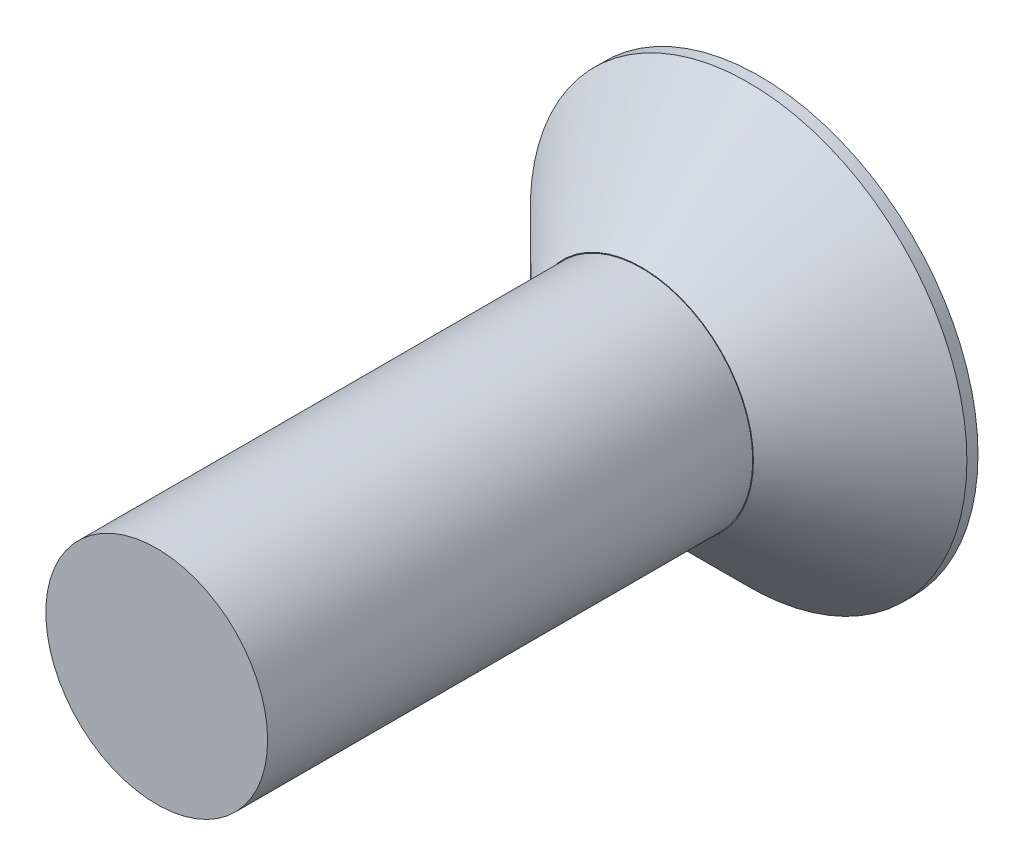
ISO-10303-21;
HEADER;
FILE_DESCRIPTION(('STEP AP214'),'2;1');
FILE_NAME('part.step','',(''),(''),'','','');
FILE_SCHEMA(('AUTOMOTIVE_DESIGN { 1 0 10303 214 1 1 1 1 }'));
ENDSEC;
DATA;
#1=APPLICATION_CONTEXT('core data for automotive mechanical design processes');
#2=APPLICATION_PROTOCOL_DEFINITION('international standard','automotive_design',2000,#1);
#3=PRODUCT_CONTEXT('',#1,'mechanical');
#4=PRODUCT('Part','Part','',(#3));
#5=PRODUCT_RELATED_PRODUCT_CATEGORY('part','',(#4));
#6=PRODUCT_DEFINITION_FORMATION('','',#4);
#7=PRODUCT_DEFINITION_CONTEXT('part definition',#1,'design');
#8=PRODUCT_DEFINITION('design','',#6,#7);
#9=PRODUCT_DEFINITION_SHAPE('','',#8);
#10=(LENGTH_UNIT() NAMED_UNIT(*) SI_UNIT(.MILLI.,.METRE.));
#11=(NAMED_UNIT(*) PLANE_ANGLE_UNIT() SI_UNIT($,.RADIAN.));
#12=(NAMED_UNIT(*) SI_UNIT($,.STERADIAN.) SOLID_ANGLE_UNIT());
#13=UNCERTAINTY_MEASURE_WITH_UNIT(LENGTH_MEASURE(1.E-05),#10,'distance_accuracy_value','');
#14=(GEOMETRIC_REPRESENTATION_CONTEXT(3) GLOBAL_UNCERTAINTY_ASSIGNED_CONTEXT((#13)) GLOBAL_UNIT_ASSIGNED_CONTEXT((#10,
#11,#12)) REPRESENTATION_CONTEXT('',''));
#15=CARTESIAN_POINT('',(0.,0.,0.));
#16=DIRECTION('',(0.,0.,1.));
#17=DIRECTION('',(1.,0.,0.));
#18=AXIS2_PLACEMENT_3D('',#15,#16,#17);
#19=CARTESIAN_POINT('',(0.,0.,2.159));
#20=DIRECTION('',(0.,0.,1.));
#21=DIRECTION('',(1.,0.,0.));
#22=AXIS2_PLACEMENT_3D('',#19,#20,#21);
#23=PLANE('',#22);
#24=CARTESIAN_POINT('',(0.,0.,2.159));
#25=DIRECTION('',(0.,0.,1.));
#26=DIRECTION('',(1.,0.,0.));
#27=AXIS2_PLACEMENT_3D('',#24,#25,#26);
#28=CIRCLE('',#27,2.0447);
#29=CARTESIAN_POINT('',(2.0447,0.,2.159));
#30=VERTEX_POINT('',#29);
#31=EDGE_CURVE('E39',#30,#30,#28,.T.);
#32=ORIENTED_EDGE('',*,*,#31,.T.);
#33=EDGE_LOOP('',(#32));
#34=FACE_BOUND('',#33,.T.);
#35=CARTESIAN_POINT('',(0.,0.,2.159));
#36=DIRECTION('',(0.,0.,1.));
#37=DIRECTION('',(1.,0.,0.));
#38=AXIS2_PLACEMENT_3D('',#35,#36,#37);
#39=CIRCLE('',#38,2.032);
#40=CARTESIAN_POINT('',(2.032,0.,2.159));
#41=VERTEX_POINT('',#40);
#42=EDGE_CURVE('E133',#41,#41,#39,.T.);
#43=ORIENTED_EDGE('',*,*,#42,.F.);
#44=EDGE_LOOP('',(#43));
#45=FACE_BOUND('',#44,.T.);
#46=ADVANCED_FACE('F31',(#34,#45),#23,.T.);
#47=CARTESIAN_POINT('',(0.,0.,2.159));
#48=DIRECTION('',(0.,0.,-1.));
#49=DIRECTION('',(-1.,0.,0.));
#50=AXIS2_PLACEMENT_3D('',#47,#48,#49);
#51=CYLINDRICAL_SURFACE('',#50,4.0005);
#52=CARTESIAN_POINT('',(0.,0.,0.203199999999997));
#53=DIRECTION('',(0.,0.,1.));
#54=DIRECTION('',(1.,0.,0.));
#55=AXIS2_PLACEMENT_3D('',#52,#53,#54);
#56=CIRCLE('',#55,4.0005);
#57=CARTESIAN_POINT('',(4.0005,0.,0.203199999999997));
#58=VERTEX_POINT('',#57);
#59=EDGE_CURVE('E11',#58,#58,#56,.F.);
#60=ORIENTED_EDGE('',*,*,#59,.T.);
#61=EDGE_LOOP('',(#60));
#62=FACE_BOUND('',#61,.T.);
#63=CARTESIAN_POINT('',(0.,0.,0.));
#64=DIRECTION('',(0.,0.,1.));
#65=DIRECTION('',(1.,0.,0.));
#66=AXIS2_PLACEMENT_3D('',#63,#64,#65);
#67=CIRCLE('',#66,4.0005);
#68=CARTESIAN_POINT('',(4.0005,0.,0.));
#69=VERTEX_POINT('',#68);
#70=EDGE_CURVE('E142',#69,#69,#67,.T.);
#71=ORIENTED_EDGE('',*,*,#70,.T.);
#72=EDGE_LOOP('',(#71));
#73=FACE_BOUND('',#72,.T.);
#74=ADVANCED_FACE('F160',(#62,#73),#51,.T.);
#75=CARTESIAN_POINT('',(0.,0.,0.));
#76=DIRECTION('',(0.,0.,1.));
#77=DIRECTION('',(1.,0.,0.));
#78=AXIS2_PLACEMENT_3D('',#75,#76,#77);
#79=PLANE('',#78);
#80=DIRECTION('',(0.854365911450463,0.51967190548597,0.));
#81=VECTOR('',#80,1.);
#82=CARTESIAN_POINT('',(-1.20603203807755,0.660002962592226,0.));
#83=LINE('',#82,#81);
#84=CARTESIAN_POINT('',(-1.20603203807755,0.660002962592226,0.));
#85=VERTEX_POINT('',#84);
#86=CARTESIAN_POINT('',(-0.0314366868609174,1.37445586404919,0.));
#87=VERTEX_POINT('',#86);
#88=EDGE_CURVE('E120',#85,#87,#83,.T.);
#89=ORIENTED_EDGE('',*,*,#88,.F.);
#90=DIRECTION('',(-0.0228661160586837,0.999738536186533,0.));
#91=VECTOR('',#90,1.);
#92=CARTESIAN_POINT('',(-1.17459535121663,-0.714452901456967,0.));
#93=LINE('',#92,#91);
#94=CARTESIAN_POINT('',(-1.17459535121663,-0.714452901456967,0.));
#95=VERTEX_POINT('',#94);
#96=EDGE_CURVE('E46',#95,#85,#93,.T.);
#97=ORIENTED_EDGE('',*,*,#96,.F.);
#98=DIRECTION('',(-0.877232027509147,0.480066630700563,0.));
#99=VECTOR('',#98,1.);
#100=CARTESIAN_POINT('',(0.0314366868609158,-1.37445586404919,0.));
#101=LINE('',#100,#99);
#102=CARTESIAN_POINT('',(0.0314366868609158,-1.37445586404919,0.));
#103=VERTEX_POINT('',#102);
#104=EDGE_CURVE('E129',#103,#95,#101,.T.);
#105=ORIENTED_EDGE('',*,*,#104,.F.);
#106=DIRECTION('',(-0.854365911450464,-0.51967190548597,0.));
#107=VECTOR('',#106,1.);
#108=CARTESIAN_POINT('',(1.20603203807755,-0.660002962592225,0.));
#109=LINE('',#108,#107);
#110=CARTESIAN_POINT('',(1.20603203807755,-0.660002962592225,0.));
#111=VERTEX_POINT('',#110);
#112=EDGE_CURVE('E127',#111,#103,#109,.T.);
#113=ORIENTED_EDGE('',*,*,#112,.F.);
#114=DIRECTION('',(0.0228661160586835,-0.999738536186533,0.));
#115=VECTOR('',#114,1.);
#116=CARTESIAN_POINT('',(1.17459535121663,0.714452901456966,0.));
#117=LINE('',#116,#115);
#118=CARTESIAN_POINT('',(1.17459535121663,0.714452901456966,0.));
#119=VERTEX_POINT('',#118);
#120=EDGE_CURVE('E94',#119,#111,#117,.T.);
#121=ORIENTED_EDGE('',*,*,#120,.F.);
#122=DIRECTION('',(0.877232027509148,-0.480066630700563,0.));
#123=VECTOR('',#122,1.);
#124=CARTESIAN_POINT('',(-0.0314366868609174,1.37445586404919,0.));
#125=LINE('',#124,#123);
#126=EDGE_CURVE('E123',#87,#119,#125,.T.);
#127=ORIENTED_EDGE('',*,*,#126,.F.);
#128=EDGE_LOOP('',(#89,#97,#105,#113,#121,#127));
#129=FACE_BOUND('',#128,.T.);
#130=ORIENTED_EDGE('',*,*,#70,.F.);
#131=EDGE_LOOP('',(#130));
#132=FACE_BOUND('',#131,.T.);
#133=ADVANCED_FACE('F165',(#129,#132),#79,.F.);
#134=CARTESIAN_POINT('',(0.,0.,11.049));
#135=DIRECTION('',(0.,0.,-1.));
#136=DIRECTION('',(-1.,0.,0.));
#137=AXIS2_PLACEMENT_3D('',#134,#135,#136);
#138=CYLINDRICAL_SURFACE('',#137,2.032);
#139=CARTESIAN_POINT('',(0.,0.,11.049));
#140=DIRECTION('',(0.,0.,1.));
#141=DIRECTION('',(1.,0.,0.));
#142=AXIS2_PLACEMENT_3D('',#139,#140,#141);
#143=CIRCLE('',#142,2.032);
#144=CARTESIAN_POINT('',(2.032,0.,11.049));
#145=VERTEX_POINT('',#144);
#146=EDGE_CURVE('E139',#145,#145,#143,.T.);
#147=ORIENTED_EDGE('',*,*,#146,.F.);
#148=EDGE_LOOP('',(#147));
#149=FACE_BOUND('',#148,.T.);
#150=ORIENTED_EDGE('',*,*,#42,.T.);
#151=EDGE_LOOP('',(#150));
#152=FACE_BOUND('',#151,.T.);
#153=ADVANCED_FACE('F169',(#149,#152),#138,.T.);
#154=CARTESIAN_POINT('',(0.,0.,11.049));
#155=DIRECTION('',(0.,0.,1.));
#156=DIRECTION('',(1.,0.,0.));
#157=AXIS2_PLACEMENT_3D('',#154,#155,#156);
#158=PLANE('',#157);
#159=ORIENTED_EDGE('',*,*,#146,.T.);
#160=EDGE_LOOP('',(#159));
#161=FACE_BOUND('',#160,.T.);
#162=ADVANCED_FACE('F176',(#161),#158,.T.);
#163=CARTESIAN_POINT('',(-1.17459535121663,-0.714452901456967,1.016));
#164=DIRECTION('',(-0.999738536186533,-0.0228661160586837,0.));
#165=DIRECTION('',(0.0228661160586837,-0.999738536186533,0.));
#166=AXIS2_PLACEMENT_3D('',#163,#164,#165);
#167=PLANE('',#166);
#168=ORIENTED_EDGE('',*,*,#96,.T.);
#169=DIRECTION('',(0.,0.,-1.));
#170=VECTOR('',#169,1.);
#171=CARTESIAN_POINT('',(-1.20603203807755,0.660002962592226,1.016));
#172=LINE('',#171,#170);
#173=CARTESIAN_POINT('',(-1.20603203807755,0.660002962592226,1.016));
#174=VERTEX_POINT('',#173);
#175=EDGE_CURVE('E76',#174,#85,#172,.T.);
#176=ORIENTED_EDGE('',*,*,#175,.F.);
#177=DIRECTION('',(-0.0228661160586837,0.999738536186533,0.));
#178=VECTOR('',#177,1.);
#179=CARTESIAN_POINT('',(-1.17459535121663,-0.714452901456967,1.016));
#180=LINE('',#179,#178);
#181=CARTESIAN_POINT('',(-1.17459535121663,-0.714452901456967,1.016));
#182=VERTEX_POINT('',#181);
#183=EDGE_CURVE('E131',#182,#174,#180,.T.);
#184=ORIENTED_EDGE('',*,*,#183,.F.);
#185=DIRECTION('',(0.,0.,-1.));
#186=VECTOR('',#185,1.);
#187=CARTESIAN_POINT('',(-1.17459535121663,-0.714452901456967,1.016));
#188=LINE('',#187,#186);
#189=EDGE_CURVE('E54',#182,#95,#188,.T.);
#190=ORIENTED_EDGE('',*,*,#189,.T.);
#191=EDGE_LOOP('',(#168,#176,#184,#190));
#192=FACE_BOUND('',#191,.T.);
#193=ADVANCED_FACE('F186',(#192),#167,.F.);
#194=CARTESIAN_POINT('',(0.0314366868609158,-1.37445586404919,1.016));
#195=DIRECTION('',(-0.480066630700563,-0.877232027509147,0.));
#196=DIRECTION('',(0.877232027509147,-0.480066630700563,0.));
#197=AXIS2_PLACEMENT_3D('',#194,#195,#196);
#198=PLANE('',#197);
#199=ORIENTED_EDGE('',*,*,#104,.T.);
#200=ORIENTED_EDGE('',*,*,#189,.F.);
#201=DIRECTION('',(-0.877232027509147,0.480066630700563,0.));
#202=VECTOR('',#201,1.);
#203=CARTESIAN_POINT('',(0.0314366868609158,-1.37445586404919,1.016));
#204=LINE('',#203,#202);
#205=CARTESIAN_POINT('',(0.0314366868609158,-1.37445586404919,1.016));
#206=VERTEX_POINT('',#205);
#207=EDGE_CURVE('E106',#206,#182,#204,.T.);
#208=ORIENTED_EDGE('',*,*,#207,.F.);
#209=DIRECTION('',(0.,0.,-1.));
#210=VECTOR('',#209,1.);
#211=CARTESIAN_POINT('',(0.0314366868609158,-1.37445586404919,1.016));
#212=LINE('',#211,#210);
#213=EDGE_CURVE('E98',#206,#103,#212,.T.);
#214=ORIENTED_EDGE('',*,*,#213,.T.);
#215=EDGE_LOOP('',(#199,#200,#208,#214));
#216=FACE_BOUND('',#215,.T.);
#217=ADVANCED_FACE('F188',(#216),#198,.F.);
#218=CARTESIAN_POINT('',(1.20603203807755,-0.660002962592225,1.016));
#219=DIRECTION('',(0.51967190548597,-0.854365911450464,0.));
#220=DIRECTION('',(0.854365911450464,0.51967190548597,0.));
#221=AXIS2_PLACEMENT_3D('',#218,#219,#220);
#222=PLANE('',#221);
#223=ORIENTED_EDGE('',*,*,#112,.T.);
#224=ORIENTED_EDGE('',*,*,#213,.F.);
#225=DIRECTION('',(-0.854365911450464,-0.51967190548597,0.));
#226=VECTOR('',#225,1.);
#227=CARTESIAN_POINT('',(1.20603203807755,-0.660002962592225,1.016));
#228=LINE('',#227,#226);
#229=CARTESIAN_POINT('',(1.20603203807755,-0.660002962592225,1.016));
#230=VERTEX_POINT('',#229);
#231=EDGE_CURVE('E102',#230,#206,#228,.T.);
#232=ORIENTED_EDGE('',*,*,#231,.F.);
#233=DIRECTION('',(0.,0.,-1.));
#234=VECTOR('',#233,1.);
#235=CARTESIAN_POINT('',(1.20603203807755,-0.660002962592225,1.016));
#236=LINE('',#235,#234);
#237=EDGE_CURVE('E87',#230,#111,#236,.T.);
#238=ORIENTED_EDGE('',*,*,#237,.T.);
#239=EDGE_LOOP('',(#223,#224,#232,#238));
#240=FACE_BOUND('',#239,.T.);
#241=ADVANCED_FACE('F103',(#240),#222,.F.);
#242=CARTESIAN_POINT('',(1.17459535121663,0.714452901456966,1.016));
#243=DIRECTION('',(0.999738536186533,0.0228661160586835,0.));
#244=DIRECTION('',(-0.0228661160586835,0.999738536186533,0.));
#245=AXIS2_PLACEMENT_3D('',#242,#243,#244);
#246=PLANE('',#245);
#247=ORIENTED_EDGE('',*,*,#120,.T.);
#248=ORIENTED_EDGE('',*,*,#237,.F.);
#249=DIRECTION('',(0.0228661160586835,-0.999738536186533,0.));
#250=VECTOR('',#249,1.);
#251=CARTESIAN_POINT('',(1.17459535121663,0.714452901456966,1.016));
#252=LINE('',#251,#250);
#253=CARTESIAN_POINT('',(1.17459535121663,0.714452901456966,1.016));
#254=VERTEX_POINT('',#253);
#255=EDGE_CURVE('E91',#254,#230,#252,.T.);
#256=ORIENTED_EDGE('',*,*,#255,.F.);
#257=DIRECTION('',(0.,0.,-1.));
#258=VECTOR('',#257,1.);
#259=CARTESIAN_POINT('',(1.17459535121663,0.714452901456966,1.016));
#260=LINE('',#259,#258);
#261=EDGE_CURVE('E99',#254,#119,#260,.T.);
#262=ORIENTED_EDGE('',*,*,#261,.T.);
#263=EDGE_LOOP('',(#247,#248,#256,#262));
#264=FACE_BOUND('',#263,.T.);
#265=ADVANCED_FACE('F89',(#264),#246,.F.);
#266=CARTESIAN_POINT('',(-0.0314366868609174,1.37445586404919,1.016));
#267=DIRECTION('',(0.480066630700562,0.877232027509147,0.));
#268=DIRECTION('',(-0.877232027509148,0.480066630700563,0.));
#269=AXIS2_PLACEMENT_3D('',#266,#267,#268);
#270=PLANE('',#269);
#271=ORIENTED_EDGE('',*,*,#126,.T.);
#272=ORIENTED_EDGE('',*,*,#261,.F.);
#273=DIRECTION('',(0.877232027509148,-0.480066630700563,0.));
#274=VECTOR('',#273,1.);
#275=CARTESIAN_POINT('',(-0.0314366868609174,1.37445586404919,1.016));
#276=LINE('',#275,#274);
#277=CARTESIAN_POINT('',(-0.0314366868609174,1.37445586404919,1.016));
#278=VERTEX_POINT('',#277);
#279=EDGE_CURVE('E112',#278,#254,#276,.T.);
#280=ORIENTED_EDGE('',*,*,#279,.F.);
#281=DIRECTION('',(0.,0.,-1.));
#282=VECTOR('',#281,1.);
#283=CARTESIAN_POINT('',(-0.0314366868609174,1.37445586404919,1.016));
#284=LINE('',#283,#282);
#285=EDGE_CURVE('E136',#278,#87,#284,.T.);
#286=ORIENTED_EDGE('',*,*,#285,.T.);
#287=EDGE_LOOP('',(#271,#272,#280,#286));
#288=FACE_BOUND('',#287,.T.);
#289=ADVANCED_FACE('F199',(#288),#270,.F.);
#290=CARTESIAN_POINT('',(-1.20603203807755,0.660002962592226,1.016));
#291=DIRECTION('',(-0.51967190548597,0.854365911450464,0.));
#292=DIRECTION('',(-0.854365911450464,-0.51967190548597,0.));
#293=AXIS2_PLACEMENT_3D('',#290,#291,#292);
#294=PLANE('',#293);
#295=ORIENTED_EDGE('',*,*,#88,.T.);
#296=ORIENTED_EDGE('',*,*,#285,.F.);
#297=DIRECTION('',(0.854365911450463,0.51967190548597,0.));
#298=VECTOR('',#297,1.);
#299=CARTESIAN_POINT('',(-1.20603203807755,0.660002962592226,1.016));
#300=LINE('',#299,#298);
#301=EDGE_CURVE('E114',#174,#278,#300,.T.);
#302=ORIENTED_EDGE('',*,*,#301,.F.);
#303=ORIENTED_EDGE('',*,*,#175,.T.);
#304=EDGE_LOOP('',(#295,#296,#302,#303));
#305=FACE_BOUND('',#304,.T.);
#306=ADVANCED_FACE('F156',(#305),#294,.F.);
#307=CARTESIAN_POINT('',(-1.20603203807755,0.660002962592226,1.016));
#308=DIRECTION('',(0.,0.,-1.));
#309=DIRECTION('',(-1.,0.,0.));
#310=AXIS2_PLACEMENT_3D('',#307,#308,#309);
#311=PLANE('',#310);
#312=ORIENTED_EDGE('',*,*,#183,.T.);
#313=ORIENTED_EDGE('',*,*,#301,.T.);
#314=ORIENTED_EDGE('',*,*,#279,.T.);
#315=ORIENTED_EDGE('',*,*,#255,.T.);
#316=ORIENTED_EDGE('',*,*,#231,.T.);
#317=ORIENTED_EDGE('',*,*,#207,.T.);
#318=EDGE_LOOP('',(#312,#313,#314,#315,#316,#317));
#319=FACE_BOUND('',#318,.T.);
#320=ADVANCED_FACE('F109',(#319),#311,.T.);
#321=CARTESIAN_POINT('',(0.,0.,2.159));
#322=DIRECTION('',(0.,0.,-1.));
#323=DIRECTION('',(-1.,0.,0.));
#324=AXIS2_PLACEMENT_3D('',#321,#322,#323);
#325=CONICAL_SURFACE('',#324,2.0447,0.785398163397447);
#326=ORIENTED_EDGE('',*,*,#59,.F.);
#327=EDGE_LOOP('',(#326));
#328=FACE_BOUND('',#327,.T.);
#329=ORIENTED_EDGE('',*,*,#31,.F.);
#330=EDGE_LOOP('',(#329));
#331=FACE_BOUND('',#330,.T.);
#332=ADVANCED_FACE('F33',(#328,#331),#325,.T.);
#333=CLOSED_SHELL('',(#46,#74,#133,#153,#162,#193,#217,#241,#265,#289,#306,#320,#332));
#334=MANIFOLD_SOLID_BREP('B2',#333);
#335=ADVANCED_BREP_SHAPE_REPRESENTATION('',(#18,#334),#14);
#336=SHAPE_DEFINITION_REPRESENTATION(#9,#335);
ENDSEC;
END-ISO-10303-21;
